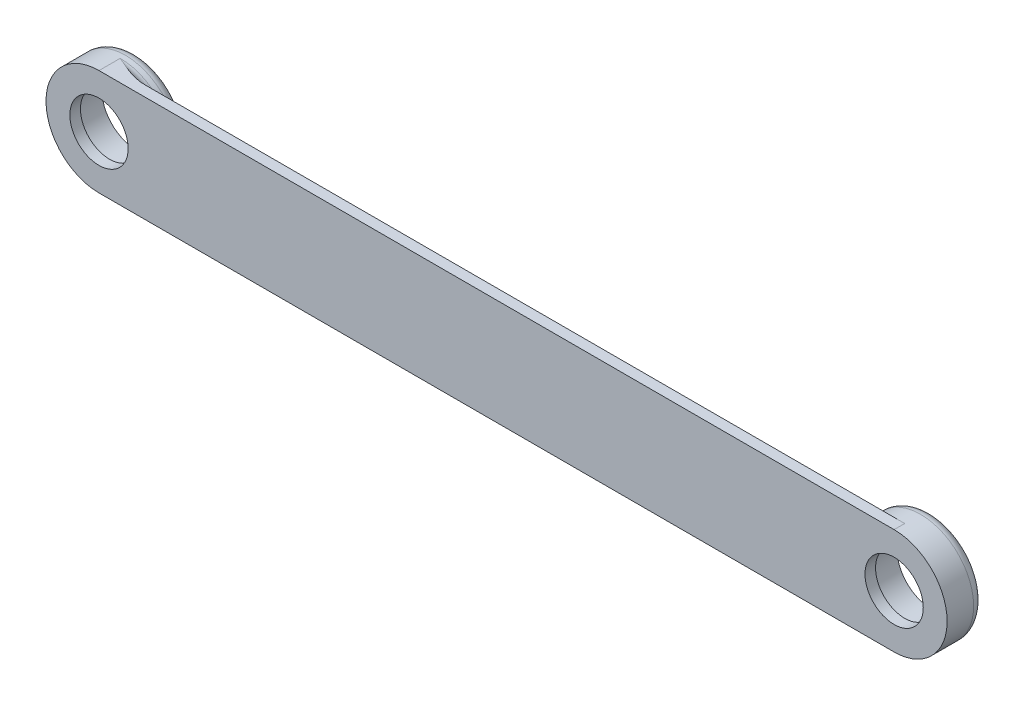
ISO-10303-21;
HEADER;
FILE_DESCRIPTION(('STEP AP214'),'2;1');
FILE_NAME('part.step','',(''),(''),'','','');
FILE_SCHEMA(('AUTOMOTIVE_DESIGN { 1 0 10303 214 1 1 1 1 }'));
ENDSEC;
DATA;
#1=APPLICATION_CONTEXT('core data for automotive mechanical design processes');
#2=APPLICATION_PROTOCOL_DEFINITION('international standard','automotive_design',2000,#1);
#3=PRODUCT_CONTEXT('',#1,'mechanical');
#4=PRODUCT('Part','Part','',(#3));
#5=PRODUCT_RELATED_PRODUCT_CATEGORY('part','',(#4));
#6=PRODUCT_DEFINITION_FORMATION('','',#4);
#7=PRODUCT_DEFINITION_CONTEXT('part definition',#1,'design');
#8=PRODUCT_DEFINITION('design','',#6,#7);
#9=PRODUCT_DEFINITION_SHAPE('','',#8);
#10=(LENGTH_UNIT() NAMED_UNIT(*) SI_UNIT(.MILLI.,.METRE.));
#11=(NAMED_UNIT(*) PLANE_ANGLE_UNIT() SI_UNIT($,.RADIAN.));
#12=(NAMED_UNIT(*) SI_UNIT($,.STERADIAN.) SOLID_ANGLE_UNIT());
#13=UNCERTAINTY_MEASURE_WITH_UNIT(LENGTH_MEASURE(1.E-05),#10,'distance_accuracy_value','');
#14=(GEOMETRIC_REPRESENTATION_CONTEXT(3) GLOBAL_UNCERTAINTY_ASSIGNED_CONTEXT((#13)) GLOBAL_UNIT_ASSIGNED_CONTEXT((#10,
#11,#12)) REPRESENTATION_CONTEXT('',''));
#15=CARTESIAN_POINT('',(0.,0.,0.));
#16=DIRECTION('',(0.,0.,1.));
#17=DIRECTION('',(1.,0.,0.));
#18=AXIS2_PLACEMENT_3D('',#15,#16,#17);
#19=CARTESIAN_POINT('',(-328.10416838123,69.1198566193202,-3.));
#20=DIRECTION('',(0.,-1.,0.));
#21=DIRECTION('',(0.,0.,-1.));
#22=AXIS2_PLACEMENT_3D('',#19,#20,#21);
#23=PLANE('',#22);
#24=DIRECTION('',(0.,0.,1.));
#25=VECTOR('',#24,1.);
#26=CARTESIAN_POINT('',(-195.36285390644,69.1198566193202,-5.));
#27=LINE('',#26,#25);
#28=CARTESIAN_POINT('',(-195.36285390644,69.1198566193202,-3.));
#29=VERTEX_POINT('',#28);
#30=CARTESIAN_POINT('',(-195.36285390644,69.1198566193202,-2.));
#31=VERTEX_POINT('',#30);
#32=EDGE_CURVE('E129',#29,#31,#27,.T.);
#33=ORIENTED_EDGE('',*,*,#32,.T.);
#34=CARTESIAN_POINT('',(-195.362858569343,69.1198556678168,-2.));
#35=CARTESIAN_POINT('',(-195.362858336578,69.1198562686821,-1.94450729056827));
#36=CARTESIAN_POINT('',(-195.365217452666,69.1198565232939,-1.88904151138226));
#37=CARTESIAN_POINT('',(-195.374623889953,69.1198567153373,-1.77851425756398));
#38=CARTESIAN_POINT('',(-195.3816707629,69.1198566527993,-1.72345274478398));
#39=CARTESIAN_POINT('',(-195.409755449191,69.1198565525139,-1.55963222928296));
#40=CARTESIAN_POINT('',(-195.437737651278,69.119856601417,-1.4519824944535));
#41=CARTESIAN_POINT('',(-195.511336321575,69.1198566372278,-1.24293066686805));
#42=CARTESIAN_POINT('',(-195.556957150815,69.1198566241201,-1.14153012637709));
#43=CARTESIAN_POINT('',(-195.664413237937,69.1198566145202,-0.947712652979805));
#44=CARTESIAN_POINT('',(-195.726248700822,69.1198566180282,-0.8552958336762));
#45=CARTESIAN_POINT('',(-195.864959562306,69.1198566206248,-0.68106457189013));
#46=CARTESIAN_POINT('',(-195.941975917116,69.11985661967,-0.59936246289728));
#47=CARTESIAN_POINT('',(-196.108426498733,69.1198566189703,-0.449746899219235));
#48=CARTESIAN_POINT('',(-196.197863690942,69.1198566192257,-0.381836746844056));
#49=CARTESIAN_POINT('',(-196.388373364515,69.1198566194164,-0.260446189153557));
#50=CARTESIAN_POINT('',(-196.489630092747,69.1198566193458,-0.207255170963922));
#51=CARTESIAN_POINT('',(-196.699540486675,69.1198566192946,-0.118397327856484));
#52=CARTESIAN_POINT('',(-196.808191137094,69.119856619314,-0.0827234075658366));
#53=CARTESIAN_POINT('',(-196.997263813077,69.1198566193246,-0.0375874257151841));
#54=CARTESIAN_POINT('',(-197.076615509554,69.1198566193224,-0.0235058063336761));
#55=CARTESIAN_POINT('',(-197.23631365992,69.119856619318,-0.00471187672142085));
#56=CARTESIAN_POINT('',(-197.316658656409,69.1198566193158,1.28233941324316E-05));
#57=CARTESIAN_POINT('',(-197.397037539184,69.1198566193202,0.));
#58=B_SPLINE_CURVE_WITH_KNOTS('',3,(#34,#35,#36,#37,#38,#39,#40,#41,#42,#43,#44,#45,#46,#47,#48,
#49,#50,#51,#52,#53,#54,#55,#56,#57),.UNSPECIFIED.,.F.,.F.,(4,2,2,2,2,2,2,2,2,2,2,4),(0.,
0.16637471700501,0.332733527259656,0.664696717849702,0.99674203663338,1.32879155371605,
1.66408323601929,1.99945510528208,2.34101540747267,2.68243724489184,2.92369002044417,
3.16462312903128),.UNSPECIFIED.);
#59=CARTESIAN_POINT('',(-197.397037539184,69.1198566193202,0.));
#60=VERTEX_POINT('',#59);
#61=EDGE_CURVE('E62',#31,#60,#58,.T.);
#62=ORIENTED_EDGE('',*,*,#61,.T.);
#63=DIRECTION('',(1.,0.,0.));
#64=VECTOR('',#63,1.);
#65=CARTESIAN_POINT('',(-185.564768197142,69.1198566193202,0.));
#66=LINE('',#65,#64);
#67=CARTESIAN_POINT('',(-325.767438161718,69.1198566193202,0.));
#68=VERTEX_POINT('',#67);
#69=EDGE_CURVE('E144',#68,#60,#66,.T.);
#70=ORIENTED_EDGE('',*,*,#69,.F.);
#71=DIRECTION('',(0.,0.,1.));
#72=VECTOR('',#71,1.);
#73=CARTESIAN_POINT('',(-325.767438161718,69.1198566193202,-5.));
#74=LINE('',#73,#72);
#75=CARTESIAN_POINT('',(-325.767438161718,69.1198566193202,-3.));
#76=VERTEX_POINT('',#75);
#77=EDGE_CURVE('E256',#68,#76,#74,.F.);
#78=ORIENTED_EDGE('',*,*,#77,.T.);
#79=DIRECTION('',(1.,0.,0.));
#80=VECTOR('',#79,1.);
#81=CARTESIAN_POINT('',(-328.10416838123,69.1198566193202,-3.));
#82=LINE('',#81,#80);
#83=EDGE_CURVE('E251',#76,#29,#82,.T.);
#84=ORIENTED_EDGE('',*,*,#83,.T.);
#85=EDGE_LOOP('',(#33,#62,#70,#78,#84));
#86=FACE_BOUND('',#85,.T.);
#87=ADVANCED_FACE('F34',(#86),#23,.T.);
#88=CARTESIAN_POINT('',(-328.10416838123,73.1198566193202,-3.));
#89=DIRECTION('',(0.,1.,0.));
#90=DIRECTION('',(0.,0.,1.));
#91=AXIS2_PLACEMENT_3D('',#88,#89,#90);
#92=PLANE('',#91);
#93=DIRECTION('',(-1.,0.,0.));
#94=VECTOR('',#93,1.);
#95=CARTESIAN_POINT('',(-185.564768197142,73.1198566193202,0.));
#96=LINE('',#95,#94);
#97=CARTESIAN_POINT('',(-195.362600389113,73.1198566193202,0.));
#98=VERTEX_POINT('',#97);
#99=CARTESIAN_POINT('',(-323.733233600486,73.1198566193202,0.));
#100=VERTEX_POINT('',#99);
#101=EDGE_CURVE('E133',#98,#100,#96,.T.);
#102=ORIENTED_EDGE('',*,*,#101,.F.);
#103=DIRECTION('',(0.,0.,1.));
#104=VECTOR('',#103,1.);
#105=CARTESIAN_POINT('',(-195.362600389113,73.1198566193202,-5.));
#106=LINE('',#105,#104);
#107=CARTESIAN_POINT('',(-195.362600389113,73.1198566193202,-3.));
#108=VERTEX_POINT('',#107);
#109=EDGE_CURVE('E118',#98,#108,#106,.F.);
#110=ORIENTED_EDGE('',*,*,#109,.T.);
#111=DIRECTION('',(-1.,0.,0.));
#112=VECTOR('',#111,1.);
#113=CARTESIAN_POINT('',(-328.10416838123,73.1198566193202,-3.));
#114=LINE('',#113,#112);
#115=CARTESIAN_POINT('',(-325.767438161718,73.1198566193202,-3.));
#116=VERTEX_POINT('',#115);
#117=EDGE_CURVE('E253',#108,#116,#114,.T.);
#118=ORIENTED_EDGE('',*,*,#117,.T.);
#119=DIRECTION('',(0.,0.,1.));
#120=VECTOR('',#119,1.);
#121=CARTESIAN_POINT('',(-325.767438161718,73.1198566193202,-5.));
#122=LINE('',#121,#120);
#123=CARTESIAN_POINT('',(-325.767438161718,73.1198566193202,-2.));
#124=VERTEX_POINT('',#123);
#125=EDGE_CURVE('E293',#116,#124,#122,.T.);
#126=ORIENTED_EDGE('',*,*,#125,.T.);
#127=CARTESIAN_POINT('',(-325.767438161718,73.1198566193202,-2.));
#128=CARTESIAN_POINT('',(-325.767438517417,73.1198566193202,-1.94450786328142));
#129=CARTESIAN_POINT('',(-325.765079464969,73.1198566193202,-1.88904265981733));
#130=CARTESIAN_POINT('',(-325.7556731179,73.1198566193202,-1.77851656456116));
#131=CARTESIAN_POINT('',(-325.748626271939,73.1198566193202,-1.72345563458663));
#132=CARTESIAN_POINT('',(-325.720541742629,73.1198566193202,-1.55963691868997));
#133=CARTESIAN_POINT('',(-325.692559746296,73.1198566193202,-1.45198839707287));
#134=CARTESIAN_POINT('',(-325.61896170373,73.1198566193202,-1.24293895663262));
#135=CARTESIAN_POINT('',(-325.57334129894,73.1198566193202,-1.14153958919935));
#136=CARTESIAN_POINT('',(-325.465886368702,73.1198566193202,-0.947724285279475));
#137=CARTESIAN_POINT('',(-325.404051635667,73.1198566193202,-0.855308463827529));
#138=CARTESIAN_POINT('',(-325.265342091131,73.1198566193202,-0.68107825674814));
#139=CARTESIAN_POINT('',(-325.188326220942,73.1198566193202,-0.599376285933245));
#140=CARTESIAN_POINT('',(-325.021876792029,73.1198566193202,-0.449760707915676));
#141=CARTESIAN_POINT('',(-324.932440267703,73.1198566193202,-0.381850403227382));
#142=CARTESIAN_POINT('',(-324.741930777931,73.1198566193202,-0.260458272758627));
#143=CARTESIAN_POINT('',(-324.640673429297,73.1198566193202,-0.207266044100401));
#144=CARTESIAN_POINT('',(-324.43076165897,73.1198566193202,-0.118405709424569));
#145=CARTESIAN_POINT('',(-324.3221102516,73.1198566193202,-0.0827305104198499));
#146=CARTESIAN_POINT('',(-324.133032036435,73.1198566193202,-0.0375913006430021));
#147=CARTESIAN_POINT('',(-324.053675492313,73.1198566193202,-0.0235082337299862));
#148=CARTESIAN_POINT('',(-323.893967489516,73.1198566193202,-0.00471236562919754));
#149=CARTESIAN_POINT('',(-323.813617488371,73.1198566193202,1.28260365413737E-05));
#150=CARTESIAN_POINT('',(-323.733233600486,73.1198566193202,0.));
#151=B_SPLINE_CURVE_WITH_KNOTS('',3,(#127,#128,#129,#130,#131,#132,#133,#134,#135,#136,#137,
#138,#139,#140,#141,#142,#143,#144,#145,#146,#147,#148,#149,#150),.UNSPECIFIED.,.F.,.F.,(4,2,2,
2,2,2,2,2,2,2,2,4),(0.,0.166372983377506,0.332730045782209,0.664689578529887,0.996731192974362,
1.32877705866475,1.66406747882743,1.99943809228917,2.34100173636094,2.68242696035828,
2.92369473373536,3.1646428376412),.UNSPECIFIED.);
#152=EDGE_CURVE('E142',#124,#100,#151,.T.);
#153=ORIENTED_EDGE('',*,*,#152,.T.);
#154=EDGE_LOOP('',(#102,#110,#118,#126,#153));
#155=FACE_BOUND('',#154,.T.);
#156=ADVANCED_FACE('F140',(#155),#92,.T.);
#157=CARTESIAN_POINT('',(-185.564768197142,71.1192356312304,0.));
#158=DIRECTION('',(0.,0.,1.));
#159=DIRECTION('',(1.,0.,0.));
#160=AXIS2_PLACEMENT_3D('',#157,#158,#159);
#161=PLANE('',#160);
#162=ORIENTED_EDGE('',*,*,#69,.T.);
#163=CARTESIAN_POINT('',(-185.564768197142,71.1192356312304,0.));
#164=DIRECTION('',(0.,0.,1.));
#165=DIRECTION('',(1.,0.,0.));
#166=AXIS2_PLACEMENT_3D('',#163,#164,#165);
#167=CIRCLE('',#166,12.0000047589946);
#168=CARTESIAN_POINT('',(-192.199891182354,61.1204728484154,0.));
#169=VERTEX_POINT('',#168);
#170=EDGE_CURVE('E48',#60,#169,#167,.T.);
#171=ORIENTED_EDGE('',*,*,#170,.T.);
#172=DIRECTION('',(1.,0.,0.));
#173=VECTOR('',#172,1.);
#174=CARTESIAN_POINT('',(-185.722368936064,61.1204728484154,0.));
#175=LINE('',#174,#173);
#176=CARTESIAN_POINT('',(-335.564768195857,61.1204728484154,0.));
#177=VERTEX_POINT('',#176);
#178=EDGE_CURVE('E316',#177,#169,#175,.T.);
#179=ORIENTED_EDGE('',*,*,#178,.F.);
#180=CARTESIAN_POINT('',(-335.564768195857,71.1198566193202,0.));
#181=DIRECTION('',(0.,0.,-1.));
#182=DIRECTION('',(-1.,0.,0.));
#183=AXIS2_PLACEMENT_3D('',#180,#181,#182);
#184=CIRCLE('',#183,9.99938377090485);
#185=EDGE_CURVE('E290',#68,#177,#184,.T.);
#186=ORIENTED_EDGE('',*,*,#185,.F.);
#187=EDGE_LOOP('',(#162,#171,#179,#186));
#188=FACE_BOUND('',#187,.T.);
#189=ADVANCED_FACE('F210',(#188),#161,.F.);
#190=CARTESIAN_POINT('',(-185.564768197142,71.1192356312304,0.));
#191=DIRECTION('',(0.,0.,1.));
#192=DIRECTION('',(1.,0.,0.));
#193=AXIS2_PLACEMENT_3D('',#190,#191,#192);
#194=CIRCLE('',#193,5.50000000000002);
#195=CARTESIAN_POINT('',(-180.064768197142,71.1192356312304,0.));
#196=VERTEX_POINT('',#195);
#197=EDGE_CURVE('E304',#196,#196,#194,.T.);
#198=ORIENTED_EDGE('',*,*,#197,.T.);
#199=EDGE_LOOP('',(#198));
#200=FACE_BOUND('',#199,.T.);
#201=CARTESIAN_POINT('',(-185.564768197142,71.1192356312304,0.));
#202=DIRECTION('',(0.,0.,-1.));
#203=DIRECTION('',(-1.,0.,0.));
#204=AXIS2_PLACEMENT_3D('',#201,#202,#203);
#205=CIRCLE('',#204,6.45000000000002);
#206=CARTESIAN_POINT('',(-192.014768197142,71.1192356312304,0.));
#207=VERTEX_POINT('',#206);
#208=EDGE_CURVE('E481',#207,#207,#205,.T.);
#209=ORIENTED_EDGE('',*,*,#208,.T.);
#210=EDGE_LOOP('',(#209));
#211=FACE_BOUND('',#210,.T.);
#212=ADVANCED_FACE('F397',(#200,#211),#161,.F.);
#213=CARTESIAN_POINT('',(-335.564768195857,71.1198566193202,0.));
#214=DIRECTION('',(0.,0.,1.));
#215=DIRECTION('',(1.,0.,0.));
#216=AXIS2_PLACEMENT_3D('',#213,#214,#215);
#217=CIRCLE('',#216,5.50000000000002);
#218=CARTESIAN_POINT('',(-330.064768195857,71.1198566193202,0.));
#219=VERTEX_POINT('',#218);
#220=EDGE_CURVE('E257',#219,#219,#217,.T.);
#221=ORIENTED_EDGE('',*,*,#220,.T.);
#222=EDGE_LOOP('',(#221));
#223=FACE_BOUND('',#222,.T.);
#224=CARTESIAN_POINT('',(-335.564768195857,71.1198566193202,0.));
#225=DIRECTION('',(0.,0.,-1.));
#226=DIRECTION('',(-1.,0.,0.));
#227=AXIS2_PLACEMENT_3D('',#224,#225,#226);
#228=CIRCLE('',#227,6.44999999999999);
#229=CARTESIAN_POINT('',(-342.014768195857,71.1198566193202,0.));
#230=VERTEX_POINT('',#229);
#231=EDGE_CURVE('E291',#230,#230,#228,.T.);
#232=ORIENTED_EDGE('',*,*,#231,.T.);
#233=EDGE_LOOP('',(#232));
#234=FACE_BOUND('',#233,.T.);
#235=ADVANCED_FACE('F211',(#223,#234),#161,.F.);
#236=CARTESIAN_POINT('',(-185.564768197142,71.1192356312304,2.));
#237=DIRECTION('',(0.,0.,1.));
#238=DIRECTION('',(1.,0.,0.));
#239=AXIS2_PLACEMENT_3D('',#236,#237,#238);
#240=PLANE('',#239);
#241=CARTESIAN_POINT('',(-185.564768197142,71.1192356312304,2.));
#242=DIRECTION('',(0.,0.,1.));
#243=DIRECTION('',(1.,0.,0.));
#244=AXIS2_PLACEMENT_3D('',#241,#242,#243);
#245=CIRCLE('',#244,5.50000000000002);
#246=CARTESIAN_POINT('',(-180.064768197142,71.1192356312304,2.));
#247=VERTEX_POINT('',#246);
#248=EDGE_CURVE('E307',#247,#247,#245,.T.);
#249=ORIENTED_EDGE('',*,*,#248,.F.);
#250=EDGE_LOOP('',(#249));
#251=FACE_BOUND('',#250,.T.);
#252=CARTESIAN_POINT('',(-185.564768197142,71.1192356312304,2.));
#253=DIRECTION('',(0.,0.,1.));
#254=DIRECTION('',(1.,0.,0.));
#255=AXIS2_PLACEMENT_3D('',#252,#253,#254);
#256=CIRCLE('',#255,10.0000047589946);
#257=CARTESIAN_POINT('',(-185.722368936064,61.1204728484154,2.));
#258=VERTEX_POINT('',#257);
#259=CARTESIAN_POINT('',(-185.564768197142,81.119240390225,2.));
#260=VERTEX_POINT('',#259);
#261=EDGE_CURVE('E312',#258,#260,#256,.T.);
#262=ORIENTED_EDGE('',*,*,#261,.T.);
#263=DIRECTION('',(-1.,0.,0.));
#264=VECTOR('',#263,1.);
#265=CARTESIAN_POINT('',(-185.564768197142,81.119240390225,2.));
#266=LINE('',#265,#264);
#267=CARTESIAN_POINT('',(-335.564768195857,81.119240390225,2.));
#268=VERTEX_POINT('',#267);
#269=EDGE_CURVE('E315',#260,#268,#266,.T.);
#270=ORIENTED_EDGE('',*,*,#269,.T.);
#271=CARTESIAN_POINT('',(-335.564768195857,71.1198566193202,2.));
#272=DIRECTION('',(0.,0.,1.));
#273=DIRECTION('',(1.,0.,0.));
#274=AXIS2_PLACEMENT_3D('',#271,#272,#273);
#275=CIRCLE('',#274,9.99938377090481);
#276=CARTESIAN_POINT('',(-335.564768195857,61.1204728484154,2.));
#277=VERTEX_POINT('',#276);
#278=EDGE_CURVE('E318',#268,#277,#275,.T.);
#279=ORIENTED_EDGE('',*,*,#278,.T.);
#280=DIRECTION('',(1.,0.,0.));
#281=VECTOR('',#280,1.);
#282=CARTESIAN_POINT('',(-185.722368936064,61.1204728484154,2.));
#283=LINE('',#282,#281);
#284=EDGE_CURVE('E320',#277,#258,#283,.T.);
#285=ORIENTED_EDGE('',*,*,#284,.T.);
#286=EDGE_LOOP('',(#262,#270,#279,#285));
#287=FACE_BOUND('',#286,.T.);
#288=CARTESIAN_POINT('',(-335.564768195857,71.1198566193202,2.));
#289=DIRECTION('',(0.,0.,1.));
#290=DIRECTION('',(1.,0.,0.));
#291=AXIS2_PLACEMENT_3D('',#288,#289,#290);
#292=CIRCLE('',#291,5.50000000000002);
#293=CARTESIAN_POINT('',(-330.064768195857,71.1198566193202,2.));
#294=VERTEX_POINT('',#293);
#295=EDGE_CURVE('E302',#294,#294,#292,.T.);
#296=ORIENTED_EDGE('',*,*,#295,.F.);
#297=EDGE_LOOP('',(#296));
#298=FACE_BOUND('',#297,.T.);
#299=ADVANCED_FACE('F209',(#251,#287,#298),#240,.T.);
#300=CARTESIAN_POINT('',(-185.564768197142,71.1192356312304,0.));
#301=DIRECTION('',(0.,0.,-1.));
#302=DIRECTION('',(-1.,0.,0.));
#303=AXIS2_PLACEMENT_3D('',#300,#301,#302);
#304=CIRCLE('',#303,10.);
#305=CARTESIAN_POINT('',(-185.564768197142,81.1192356312304,0.));
#306=VERTEX_POINT('',#305);
#307=EDGE_CURVE('E122',#98,#306,#304,.T.);
#308=ORIENTED_EDGE('',*,*,#307,.F.);
#309=ORIENTED_EDGE('',*,*,#101,.T.);
#310=CARTESIAN_POINT('',(-335.564768195857,71.1198566193202,0.));
#311=DIRECTION('',(0.,0.,1.));
#312=DIRECTION('',(1.,0.,0.));
#313=AXIS2_PLACEMENT_3D('',#310,#311,#312);
#314=CIRCLE('',#313,11.9993837709048);
#315=CARTESIAN_POINT('',(-328.931704417811,81.119240390225,0.));
#316=VERTEX_POINT('',#315);
#317=EDGE_CURVE('E167',#100,#316,#314,.T.);
#318=ORIENTED_EDGE('',*,*,#317,.T.);
#319=DIRECTION('',(-1.,0.,0.));
#320=VECTOR('',#319,1.);
#321=CARTESIAN_POINT('',(-185.564768197142,81.119240390225,0.));
#322=LINE('',#321,#320);
#323=EDGE_CURVE('E136',#306,#316,#322,.T.);
#324=ORIENTED_EDGE('',*,*,#323,.F.);
#325=EDGE_LOOP('',(#308,#309,#318,#324));
#326=FACE_BOUND('',#325,.T.);
#327=ADVANCED_FACE('F132',(#326),#161,.F.);
#328=CARTESIAN_POINT('',(-185.564768197142,71.1192356312304,2.));
#329=DIRECTION('',(0.,0.,-1.));
#330=DIRECTION('',(-1.,0.,0.));
#331=AXIS2_PLACEMENT_3D('',#328,#329,#330);
#332=CYLINDRICAL_SURFACE('',#331,10.0000047589946);
#333=ORIENTED_EDGE('',*,*,#32,.F.);
#334=CARTESIAN_POINT('',(-185.564768197142,71.1192356312304,-3.));
#335=DIRECTION('',(0.,0.,-1.));
#336=DIRECTION('',(-1.,0.,0.));
#337=AXIS2_PLACEMENT_3D('',#334,#335,#336);
#338=CIRCLE('',#337,10.0000047589946);
#339=EDGE_CURVE('E125',#29,#108,#338,.F.);
#340=ORIENTED_EDGE('',*,*,#339,.T.);
#341=ORIENTED_EDGE('',*,*,#109,.F.);
#342=ORIENTED_EDGE('',*,*,#307,.T.);
#343=DIRECTION('',(0.,0.,-1.));
#344=VECTOR('',#343,1.);
#345=CARTESIAN_POINT('',(-185.564768197142,81.119240390225,2.));
#346=LINE('',#345,#344);
#347=EDGE_CURVE('E145',#260,#306,#346,.T.);
#348=ORIENTED_EDGE('',*,*,#347,.F.);
#349=ORIENTED_EDGE('',*,*,#261,.F.);
#350=DIRECTION('',(0.,0.,-1.));
#351=VECTOR('',#350,1.);
#352=CARTESIAN_POINT('',(-185.722368936064,61.1204728484154,2.));
#353=LINE('',#352,#351);
#354=CARTESIAN_POINT('',(-185.722368936064,61.1204728484154,-2.));
#355=VERTEX_POINT('',#354);
#356=EDGE_CURVE('E322',#258,#355,#353,.T.);
#357=ORIENTED_EDGE('',*,*,#356,.T.);
#358=CARTESIAN_POINT('',(-185.564768197142,71.1192356312304,-2.));
#359=DIRECTION('',(0.,0.,1.));
#360=DIRECTION('',(1.,0.,0.));
#361=AXIS2_PLACEMENT_3D('',#358,#359,#360);
#362=CIRCLE('',#361,10.0000047589946);
#363=EDGE_CURVE('E242',#355,#31,#362,.F.);
#364=ORIENTED_EDGE('',*,*,#363,.T.);
#365=EDGE_LOOP('',(#333,#340,#341,#342,#348,#349,#357,#364));
#366=FACE_BOUND('',#365,.T.);
#367=ADVANCED_FACE('F120',(#366),#332,.T.);
#368=CARTESIAN_POINT('',(-185.564768197142,81.119240390225,2.));
#369=DIRECTION('',(0.,-1.,0.));
#370=DIRECTION('',(1.,0.,0.));
#371=AXIS2_PLACEMENT_3D('',#368,#369,#370);
#372=PLANE('',#371);
#373=ORIENTED_EDGE('',*,*,#323,.T.);
#374=CARTESIAN_POINT('',(-328.931704417811,81.119240390225,0.));
#375=CARTESIAN_POINT('',(-329.055052647417,81.119240390225,-1.6185102834311E-05));
#376=CARTESIAN_POINT('',(-329.178361574494,81.119240390225,-0.00348589434590042));
#377=CARTESIAN_POINT('',(-329.424580908556,81.119240390225,-0.0166401792797614));
#378=CARTESIAN_POINT('',(-329.547491506303,81.119240390225,-0.0263211223289734));
#379=CARTESIAN_POINT('',(-329.792390272009,81.119240390225,-0.0511719359547092));
#380=CARTESIAN_POINT('',(-329.914380069183,81.119240390225,-0.0663261185759614));
#381=CARTESIAN_POINT('',(-330.157658680949,81.119240390225,-0.101549434328732));
#382=CARTESIAN_POINT('',(-330.278947378979,81.119240390225,-0.121619361967711));
#383=CARTESIAN_POINT('',(-330.638893099782,81.119240390225,-0.18790424900135));
#384=CARTESIAN_POINT('',(-330.876385817443,81.119240390225,-0.240499064773243));
#385=CARTESIAN_POINT('',(-331.348033743228,81.119240390225,-0.359387031821355));
#386=CARTESIAN_POINT('',(-331.582185994145,81.119240390225,-0.425691602034178));
#387=CARTESIAN_POINT('',(-332.134531072944,81.119240390225,-0.596059200234351));
#388=CARTESIAN_POINT('',(-332.451225150211,81.119240390225,-0.704946256634754));
#389=CARTESIAN_POINT('',(-333.079224927103,81.119240390225,-0.936943058320595));
#390=CARTESIAN_POINT('',(-333.390530899516,81.119240390225,-1.0600520811426));
#391=CARTESIAN_POINT('',(-334.320601329789,81.1192403902249,-1.44364445492043));
#392=CARTESIAN_POINT('',(-334.933649723195,81.1192403902245,-1.71774722364944));
#393=CARTESIAN_POINT('',(-335.552597031917,81.119240390225,-1.99455673614756));
#394=CARTESIAN_POINT('',(-335.558682619459,81.119240390225,-1.99727837768805));
#395=CARTESIAN_POINT('',(-335.564768195857,81.119240390225,-2.));
#396=B_SPLINE_CURVE_WITH_KNOTS('',3,(#374,#375,#376,#377,#378,#379,#380,#381,#382,#383,#384,
#385,#386,#387,#388,#389,#390,#391,#392,#393,#394,#395),.UNSPECIFIED.,.F.,.F.,(4,2,2,2,2,2,2,2,
2,2,4),(0.,0.369939745937328,0.739663329505726,1.10833547637741,1.47706724926333,
2.20623350962514,2.93600956119316,3.94013778497352,4.94421502233113,6.95828831077313,
6.97828769453455),.UNSPECIFIED.);
#397=CARTESIAN_POINT('',(-335.564768195857,81.119240390225,-2.));
#398=VERTEX_POINT('',#397);
#399=EDGE_CURVE('E183',#316,#398,#396,.T.);
#400=ORIENTED_EDGE('',*,*,#399,.T.);
#401=DIRECTION('',(0.,0.,-1.));
#402=VECTOR('',#401,1.);
#403=CARTESIAN_POINT('',(-335.564768195857,81.119240390225,2.));
#404=LINE('',#403,#402);
#405=EDGE_CURVE('E149',#268,#398,#404,.T.);
#406=ORIENTED_EDGE('',*,*,#405,.F.);
#407=ORIENTED_EDGE('',*,*,#269,.F.);
#408=ORIENTED_EDGE('',*,*,#347,.T.);
#409=EDGE_LOOP('',(#373,#400,#406,#407,#408));
#410=FACE_BOUND('',#409,.T.);
#411=ADVANCED_FACE('F193',(#410),#372,.F.);
#412=CARTESIAN_POINT('',(-335.564768195857,71.1198566193202,2.));
#413=DIRECTION('',(0.,0.,-1.));
#414=DIRECTION('',(-1.,0.,0.));
#415=AXIS2_PLACEMENT_3D('',#412,#413,#414);
#416=CYLINDRICAL_SURFACE('',#415,9.99938377090481);
#417=ORIENTED_EDGE('',*,*,#405,.T.);
#418=CARTESIAN_POINT('',(-335.564768195857,71.1198566193202,-2.));
#419=DIRECTION('',(0.,0.,1.));
#420=DIRECTION('',(1.,0.,0.));
#421=AXIS2_PLACEMENT_3D('',#418,#419,#420);
#422=CIRCLE('',#421,9.99938377090481);
#423=EDGE_CURVE('E157',#398,#124,#422,.F.);
#424=ORIENTED_EDGE('',*,*,#423,.T.);
#425=ORIENTED_EDGE('',*,*,#125,.F.);
#426=CARTESIAN_POINT('',(-335.564768195857,71.1198566193202,-3.));
#427=DIRECTION('',(0.,0.,-1.));
#428=DIRECTION('',(-1.,0.,0.));
#429=AXIS2_PLACEMENT_3D('',#426,#427,#428);
#430=CIRCLE('',#429,9.99938377090481);
#431=EDGE_CURVE('E155',#116,#76,#430,.F.);
#432=ORIENTED_EDGE('',*,*,#431,.T.);
#433=ORIENTED_EDGE('',*,*,#77,.F.);
#434=ORIENTED_EDGE('',*,*,#185,.T.);
#435=DIRECTION('',(0.,0.,-1.));
#436=VECTOR('',#435,1.);
#437=CARTESIAN_POINT('',(-335.564768195857,61.1204728484154,2.));
#438=LINE('',#437,#436);
#439=EDGE_CURVE('E326',#277,#177,#438,.T.);
#440=ORIENTED_EDGE('',*,*,#439,.F.);
#441=ORIENTED_EDGE('',*,*,#278,.F.);
#442=EDGE_LOOP('',(#417,#424,#425,#432,#433,#434,#440,#441));
#443=FACE_BOUND('',#442,.T.);
#444=ADVANCED_FACE('F197',(#443),#416,.T.);
#445=CARTESIAN_POINT('',(-185.722368936064,61.1204728484154,2.));
#446=DIRECTION('',(0.,1.,0.));
#447=DIRECTION('',(-1.,0.,0.));
#448=AXIS2_PLACEMENT_3D('',#445,#446,#447);
#449=PLANE('',#448);
#450=ORIENTED_EDGE('',*,*,#178,.T.);
#451=CARTESIAN_POINT('',(-192.199891182354,61.1204728484154,0.));
#452=CARTESIAN_POINT('',(-192.076890749754,61.1204728484154,-1.60281354195884E-05));
#453=CARTESIAN_POINT('',(-191.953929219473,61.1204728484154,-0.00346806941419831));
#454=CARTESIAN_POINT('',(-191.70840170011,61.1204728484154,-0.0165576662117458));
#455=CARTESIAN_POINT('',(-191.585835523049,61.1204728484154,-0.026191634670352));
#456=CARTESIAN_POINT('',(-191.341589365794,61.1204728484154,-0.0509281628894994));
#457=CARTESIAN_POINT('',(-191.219907913782,61.1204728484154,-0.0660165216624728));
#458=CARTESIAN_POINT('',(-190.97724251194,61.1204728484154,-0.101091531117429));
#459=CARTESIAN_POINT('',(-190.856258676943,61.1204728484154,-0.121078965923957));
#460=CARTESIAN_POINT('',(-190.496305099307,61.1204728484154,-0.18726697877549));
#461=CARTESIAN_POINT('',(-190.258506780856,61.1204728484154,-0.239894537571));
#462=CARTESIAN_POINT('',(-189.786319347867,61.1204728484154,-0.358899246797545));
#463=CARTESIAN_POINT('',(-189.551932319903,61.1204728484154,-0.425284462853016));
#464=CARTESIAN_POINT('',(-189.10503836072,61.1204728484154,-0.563221065063807));
#465=CARTESIAN_POINT('',(-188.892272615659,61.1204728484154,-0.633942916550304));
#466=CARTESIAN_POINT('',(-188.469228811777,61.1204728484154,-0.78273822917118));
#467=CARTESIAN_POINT('',(-188.25895207171,61.1204728484154,-0.860815406945587));
#468=CARTESIAN_POINT('',(-187.768098965008,61.1204728484154,-1.05065953268547));
#469=CARTESIAN_POINT('',(-187.488415967701,61.1204728484154,-1.16472426938133));
#470=CARTESIAN_POINT('',(-187.028151148418,61.1204728484154,-1.35909237586152));
#471=CARTESIAN_POINT('',(-186.846730059838,61.1204728484154,-1.4374374906076));
#472=CARTESIAN_POINT('',(-186.549089799369,61.1204728484154,-1.56833523121158));
#473=CARTESIAN_POINT('',(-186.432561980495,61.1204728484154,-1.62018273625244));
#474=CARTESIAN_POINT('',(-186.241741488609,61.1204728484154,-1.70639235426432));
#475=CARTESIAN_POINT('',(-186.16727175178,61.1204728484154,-1.74036522783606));
#476=CARTESIAN_POINT('',(-186.045498804709,61.1204728484154,-1.79707974874543));
#477=CARTESIAN_POINT('',(-185.99803936558,61.1204728484154,-1.81947553883159));
#478=CARTESIAN_POINT('',(-185.920611786994,61.1204728484154,-1.85729691295803));
#479=CARTESIAN_POINT('',(-185.890458254547,61.1204728484154,-1.87235085029522));
#480=CARTESIAN_POINT('',(-185.841354853011,61.1204728484154,-1.89823423352673));
#481=CARTESIAN_POINT('',(-185.822216989938,61.1204728484154,-1.9086730416244));
#482=CARTESIAN_POINT('',(-185.791313086444,61.1204728484154,-1.92708788157408));
#483=CARTESIAN_POINT('',(-185.779291641658,61.1204728484154,-1.93466298905029));
#484=CARTESIAN_POINT('',(-185.756670472268,61.1204728484154,-1.95061102906805));
#485=CARTESIAN_POINT('',(-185.746028771973,61.1204728484154,-1.95890649537088));
#486=CARTESIAN_POINT('',(-185.735266468918,61.1204728484154,-1.97085981626237));
#487=CARTESIAN_POINT('',(-185.733509750668,61.1204728484154,-1.97295850836701));
#488=CARTESIAN_POINT('',(-185.730244149184,61.1204728484154,-1.97734482890779));
#489=CARTESIAN_POINT('',(-185.728735190657,61.1204728484154,-1.97963239962565));
#490=CARTESIAN_POINT('',(-185.726371258629,61.1204728484154,-1.98391213715676));
#491=CARTESIAN_POINT('',(-185.725445466147,61.1204728484154,-1.98586444266313));
#492=CARTESIAN_POINT('',(-185.723920889327,61.1204728484154,-1.98989014570385));
#493=CARTESIAN_POINT('',(-185.723320794925,61.1204728484154,-1.99196302042225));
#494=CARTESIAN_POINT('',(-185.722742382086,61.1204728484154,-1.99504815595754));
#495=CARTESIAN_POINT('',(-185.722603234302,61.1204728484154,-1.99603142042788));
#496=CARTESIAN_POINT('',(-185.72241615932,61.1204728484154,-1.99800953482887));
#497=CARTESIAN_POINT('',(-185.722368508947,61.1204728484154,-1.99900441078408));
#498=CARTESIAN_POINT('',(-185.722368936065,61.1204728484154,-2.0000000000003));
#499=B_SPLINE_CURVE_WITH_KNOTS('',3,(#451,#452,#453,#454,#455,#456,#457,#458,#459,#460,#461,
#462,#463,#464,#465,#466,#467,#468,#469,#470,#471,#472,#473,#474,#475,#476,#477,#478,#479,#480,
#481,#482,#483,#484,#485,#486,#487,#488,#489,#490,#491,#492,#493,#494,#495,#496,#497,#498),
.UNSPECIFIED.,.F.,.F.,(4,2,2,2,2,2,2,2,2,2,2,2,2,2,2,2,2,2,2,2,2,2,2,4),(0.,0.368897282213895,
0.737580705286715,1.10531106148705,1.47310031346748,2.20318031919301,2.93368956183541,
3.60615803738903,4.278968152155,5.18495951499174,5.77779275314544,6.16040868381558,
6.40596970863463,6.56338534331212,6.6645044684448,6.72983357652475,6.77251287932591,
6.81257360154939,6.82077143186051,6.82896676625255,6.83542865274731,6.84186435111233,
6.84483970538857,6.84782404745633),.UNSPECIFIED.);
#500=EDGE_CURVE('E11',#169,#355,#499,.T.);
#501=ORIENTED_EDGE('',*,*,#500,.T.);
#502=ORIENTED_EDGE('',*,*,#356,.F.);
#503=ORIENTED_EDGE('',*,*,#284,.F.);
#504=ORIENTED_EDGE('',*,*,#439,.T.);
#505=EDGE_LOOP('',(#450,#501,#502,#503,#504));
#506=FACE_BOUND('',#505,.T.);
#507=ADVANCED_FACE('F200',(#506),#449,.F.);
#508=CARTESIAN_POINT('',(-185.564768197142,71.1192356312304,2.));
#509=DIRECTION('',(0.,0.,-1.));
#510=DIRECTION('',(-1.,0.,0.));
#511=AXIS2_PLACEMENT_3D('',#508,#509,#510);
#512=CYLINDRICAL_SURFACE('',#511,5.50000000000002);
#513=ORIENTED_EDGE('',*,*,#248,.T.);
#514=EDGE_LOOP('',(#513));
#515=FACE_BOUND('',#514,.T.);
#516=ORIENTED_EDGE('',*,*,#197,.F.);
#517=EDGE_LOOP('',(#516));
#518=FACE_BOUND('',#517,.T.);
#519=ADVANCED_FACE('F205',(#515,#518),#512,.F.);
#520=CARTESIAN_POINT('',(-335.564768195857,71.1198566193202,2.));
#521=DIRECTION('',(0.,0.,-1.));
#522=DIRECTION('',(-1.,0.,0.));
#523=AXIS2_PLACEMENT_3D('',#520,#521,#522);
#524=CYLINDRICAL_SURFACE('',#523,5.50000000000002);
#525=ORIENTED_EDGE('',*,*,#295,.T.);
#526=EDGE_LOOP('',(#525));
#527=FACE_BOUND('',#526,.T.);
#528=ORIENTED_EDGE('',*,*,#220,.F.);
#529=EDGE_LOOP('',(#528));
#530=FACE_BOUND('',#529,.T.);
#531=ADVANCED_FACE('F216',(#527,#530),#524,.F.);
#532=CARTESIAN_POINT('',(0.,0.,-3.));
#533=DIRECTION('',(0.,0.,-1.));
#534=DIRECTION('',(-1.,0.,0.));
#535=AXIS2_PLACEMENT_3D('',#532,#533,#534);
#536=PLANE('',#535);
#537=ORIENTED_EDGE('',*,*,#117,.F.);
#538=CARTESIAN_POINT('',(-185.564768197142,71.1192356312304,-3.));
#539=DIRECTION('',(0.,0.,-1.));
#540=DIRECTION('',(-1.,0.,0.));
#541=AXIS2_PLACEMENT_3D('',#538,#539,#540);
#542=CIRCLE('',#541,10.);
#543=EDGE_CURVE('E190',#108,#29,#542,.F.);
#544=ORIENTED_EDGE('',*,*,#543,.T.);
#545=ORIENTED_EDGE('',*,*,#83,.F.);
#546=CARTESIAN_POINT('',(-335.564768195857,71.1198566193202,-3.));
#547=DIRECTION('',(0.,0.,-1.));
#548=DIRECTION('',(-1.,0.,0.));
#549=AXIS2_PLACEMENT_3D('',#546,#547,#548);
#550=CIRCLE('',#549,9.99938377090485);
#551=EDGE_CURVE('E147',#76,#116,#550,.F.);
#552=ORIENTED_EDGE('',*,*,#551,.T.);
#553=EDGE_LOOP('',(#537,#544,#545,#552));
#554=FACE_BOUND('',#553,.T.);
#555=ADVANCED_FACE('F219',(#554),#536,.T.);
#556=CARTESIAN_POINT('',(-335.564768195857,71.1198566193202,-5.));
#557=DIRECTION('',(0.,0.,-1.));
#558=DIRECTION('',(-1.,0.,0.));
#559=AXIS2_PLACEMENT_3D('',#556,#557,#558);
#560=PLANE('',#559);
#561=CARTESIAN_POINT('',(-335.564768195857,71.1198566193202,-5.));
#562=DIRECTION('',(0.,0.,-1.));
#563=DIRECTION('',(-1.,0.,0.));
#564=AXIS2_PLACEMENT_3D('',#561,#562,#563);
#565=CIRCLE('',#564,7.99938377090481);
#566=CARTESIAN_POINT('',(-343.564151966762,71.1198566193202,-5.));
#567=VERTEX_POINT('',#566);
#568=EDGE_CURVE('E191',#567,#567,#565,.T.);
#569=ORIENTED_EDGE('',*,*,#568,.T.);
#570=EDGE_LOOP('',(#569));
#571=FACE_BOUND('',#570,.T.);
#572=CARTESIAN_POINT('',(-335.564768195857,71.1198566193202,-5.));
#573=DIRECTION('',(0.,0.,-1.));
#574=DIRECTION('',(-1.,0.,0.));
#575=AXIS2_PLACEMENT_3D('',#572,#573,#574);
#576=CIRCLE('',#575,6.44999999999999);
#577=CARTESIAN_POINT('',(-342.014768195857,71.1198566193202,-5.));
#578=VERTEX_POINT('',#577);
#579=EDGE_CURVE('E289',#578,#578,#576,.T.);
#580=ORIENTED_EDGE('',*,*,#579,.F.);
#581=EDGE_LOOP('',(#580));
#582=FACE_BOUND('',#581,.T.);
#583=ADVANCED_FACE('F224',(#571,#582),#560,.T.);
#584=CARTESIAN_POINT('',(-335.564768195857,71.1198566193202,-5.));
#585=DIRECTION('',(0.,0.,1.));
#586=DIRECTION('',(1.,0.,0.));
#587=AXIS2_PLACEMENT_3D('',#584,#585,#586);
#588=CYLINDRICAL_SURFACE('',#587,6.44999999999999);
#589=ORIENTED_EDGE('',*,*,#579,.T.);
#590=EDGE_LOOP('',(#589));
#591=FACE_BOUND('',#590,.T.);
#592=ORIENTED_EDGE('',*,*,#231,.F.);
#593=EDGE_LOOP('',(#592));
#594=FACE_BOUND('',#593,.T.);
#595=ADVANCED_FACE('F178',(#591,#594),#588,.F.);
#596=CARTESIAN_POINT('',(-335.564768195857,71.1198566193202,-2.));
#597=DIRECTION('',(0.,0.,1.));
#598=DIRECTION('',(1.,0.,0.));
#599=AXIS2_PLACEMENT_3D('',#596,#597,#598);
#600=TOROIDAL_SURFACE('',#599,11.9993837709048,2.);
#601=ORIENTED_EDGE('',*,*,#399,.F.);
#602=ORIENTED_EDGE('',*,*,#317,.F.);
#603=ORIENTED_EDGE('',*,*,#152,.F.);
#604=ORIENTED_EDGE('',*,*,#423,.F.);
#605=EDGE_LOOP('',(#601,#602,#603,#604));
#606=FACE_BOUND('',#605,.T.);
#607=ADVANCED_FACE('F172',(#606),#600,.F.);
#608=CARTESIAN_POINT('',(-335.564768195857,71.1198566193202,-3.));
#609=DIRECTION('',(0.,0.,-1.));
#610=DIRECTION('',(-1.,0.,0.));
#611=AXIS2_PLACEMENT_3D('',#608,#609,#610);
#612=TOROIDAL_SURFACE('',#611,7.99938377090481,2.);
#613=ORIENTED_EDGE('',*,*,#431,.F.);
#614=ORIENTED_EDGE('',*,*,#551,.F.);
#615=EDGE_LOOP('',(#613,#614));
#616=FACE_BOUND('',#615,.T.);
#617=ORIENTED_EDGE('',*,*,#568,.F.);
#618=EDGE_LOOP('',(#617));
#619=FACE_BOUND('',#618,.T.);
#620=ADVANCED_FACE('F177',(#616,#619),#612,.T.);
#621=CARTESIAN_POINT('',(-185.564768197142,71.1192356312304,-5.));
#622=DIRECTION('',(0.,0.,-1.));
#623=DIRECTION('',(-1.,0.,0.));
#624=AXIS2_PLACEMENT_3D('',#621,#622,#623);
#625=PLANE('',#624);
#626=CARTESIAN_POINT('',(-185.564768197142,71.1192356312304,-5.));
#627=DIRECTION('',(0.,0.,-1.));
#628=DIRECTION('',(-1.,0.,0.));
#629=AXIS2_PLACEMENT_3D('',#626,#627,#628);
#630=CIRCLE('',#629,8.00000475899462);
#631=CARTESIAN_POINT('',(-193.564772956137,71.1192356312304,-5.));
#632=VERTEX_POINT('',#631);
#633=EDGE_CURVE('E244',#632,#632,#630,.T.);
#634=ORIENTED_EDGE('',*,*,#633,.T.);
#635=EDGE_LOOP('',(#634));
#636=FACE_BOUND('',#635,.T.);
#637=CARTESIAN_POINT('',(-185.564768197142,71.1192356312304,-5.));
#638=DIRECTION('',(0.,0.,-1.));
#639=DIRECTION('',(-1.,0.,0.));
#640=AXIS2_PLACEMENT_3D('',#637,#638,#639);
#641=CIRCLE('',#640,6.45000000000002);
#642=CARTESIAN_POINT('',(-192.014768197142,71.1192356312304,-5.));
#643=VERTEX_POINT('',#642);
#644=EDGE_CURVE('E138',#643,#643,#641,.T.);
#645=ORIENTED_EDGE('',*,*,#644,.F.);
#646=EDGE_LOOP('',(#645));
#647=FACE_BOUND('',#646,.T.);
#648=ADVANCED_FACE('F268',(#636,#647),#625,.T.);
#649=CARTESIAN_POINT('',(-185.564768197142,71.1192356312304,-5.));
#650=DIRECTION('',(0.,0.,1.));
#651=DIRECTION('',(1.,0.,0.));
#652=AXIS2_PLACEMENT_3D('',#649,#650,#651);
#653=CYLINDRICAL_SURFACE('',#652,6.45000000000002);
#654=ORIENTED_EDGE('',*,*,#644,.T.);
#655=EDGE_LOOP('',(#654));
#656=FACE_BOUND('',#655,.T.);
#657=ORIENTED_EDGE('',*,*,#208,.F.);
#658=EDGE_LOOP('',(#657));
#659=FACE_BOUND('',#658,.T.);
#660=ADVANCED_FACE('F262',(#656,#659),#653,.F.);
#661=CARTESIAN_POINT('',(-185.564768197142,71.1192356312304,-3.));
#662=DIRECTION('',(0.,0.,-1.));
#663=DIRECTION('',(-1.,0.,0.));
#664=AXIS2_PLACEMENT_3D('',#661,#662,#663);
#665=TOROIDAL_SURFACE('',#664,8.00000475899462,2.);
#666=ORIENTED_EDGE('',*,*,#543,.F.);
#667=ORIENTED_EDGE('',*,*,#339,.F.);
#668=EDGE_LOOP('',(#666,#667));
#669=FACE_BOUND('',#668,.T.);
#670=ORIENTED_EDGE('',*,*,#633,.F.);
#671=EDGE_LOOP('',(#670));
#672=FACE_BOUND('',#671,.T.);
#673=ADVANCED_FACE('F259',(#669,#672),#665,.T.);
#674=CARTESIAN_POINT('',(-185.564768197142,71.1192356312304,-2.));
#675=DIRECTION('',(0.,0.,1.));
#676=DIRECTION('',(1.,0.,0.));
#677=AXIS2_PLACEMENT_3D('',#674,#675,#676);
#678=TOROIDAL_SURFACE('',#677,12.0000047589946,2.);
#679=ORIENTED_EDGE('',*,*,#500,.F.);
#680=ORIENTED_EDGE('',*,*,#170,.F.);
#681=ORIENTED_EDGE('',*,*,#61,.F.);
#682=ORIENTED_EDGE('',*,*,#363,.F.);
#683=EDGE_LOOP('',(#679,#680,#681,#682));
#684=FACE_BOUND('',#683,.T.);
#685=ADVANCED_FACE('F36',(#684),#678,.F.);
#686=CLOSED_SHELL('',(#87,#156,#189,#212,#235,#299,#327,#367,#411,#444,#507,#519,#531,#555,#583,
#595,#607,#620,#648,#660,#673,#685));
#687=MANIFOLD_SOLID_BREP('B2',#686);
#688=ADVANCED_BREP_SHAPE_REPRESENTATION('',(#18,#687),#14);
#689=SHAPE_DEFINITION_REPRESENTATION(#9,#688);
ENDSEC;
END-ISO-10303-21;
